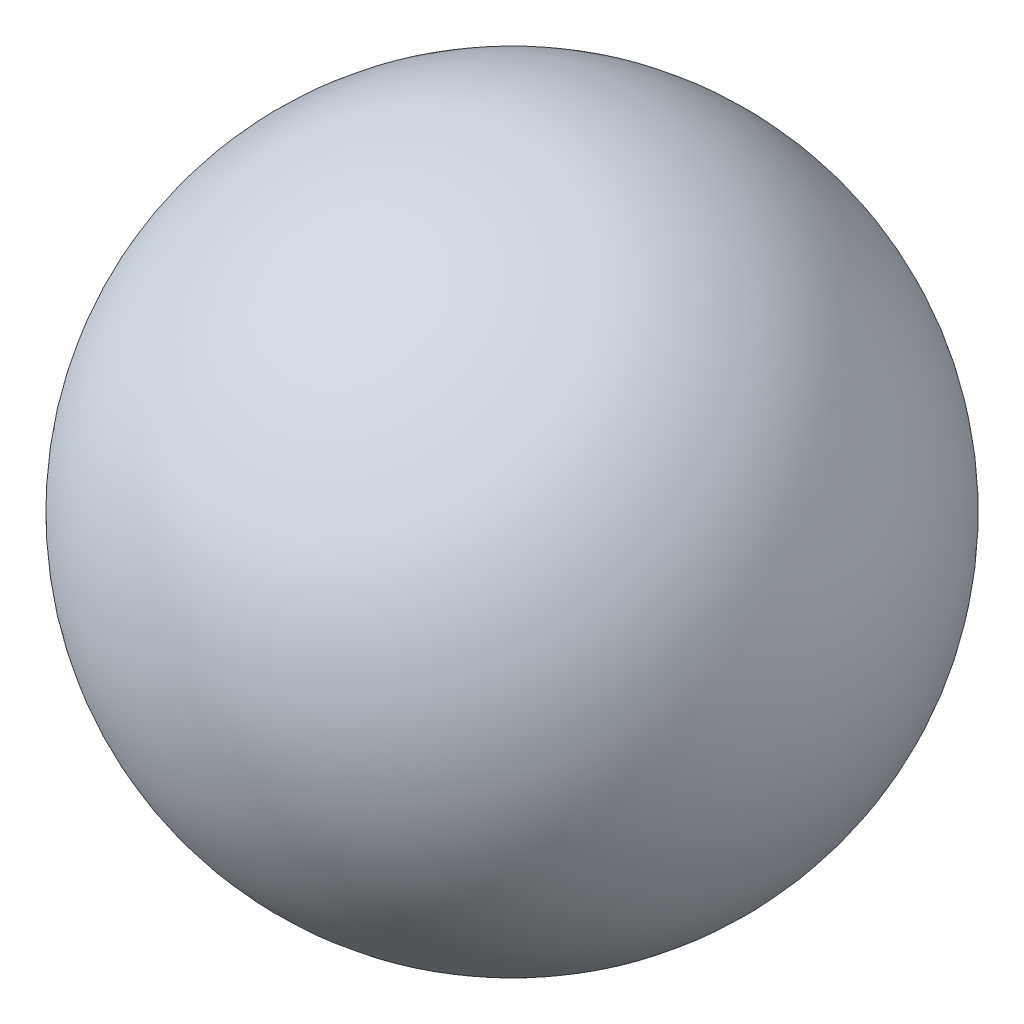
ISO-10303-21;
HEADER;
FILE_DESCRIPTION(('STEP AP214'),'2;1');
FILE_NAME('part.step','',(''),(''),'','','');
FILE_SCHEMA(('AUTOMOTIVE_DESIGN { 1 0 10303 214 1 1 1 1 }'));
ENDSEC;
DATA;
#1=APPLICATION_CONTEXT('core data for automotive mechanical design processes');
#2=APPLICATION_PROTOCOL_DEFINITION('international standard','automotive_design',2000,#1);
#3=PRODUCT_CONTEXT('',#1,'mechanical');
#4=PRODUCT('Part','Part','',(#3));
#5=PRODUCT_RELATED_PRODUCT_CATEGORY('part','',(#4));
#6=PRODUCT_DEFINITION_FORMATION('','',#4);
#7=PRODUCT_DEFINITION_CONTEXT('part definition',#1,'design');
#8=PRODUCT_DEFINITION('design','',#6,#7);
#9=PRODUCT_DEFINITION_SHAPE('','',#8);
#10=(LENGTH_UNIT() NAMED_UNIT(*) SI_UNIT(.MILLI.,.METRE.));
#11=(NAMED_UNIT(*) PLANE_ANGLE_UNIT() SI_UNIT($,.RADIAN.));
#12=(NAMED_UNIT(*) SI_UNIT($,.STERADIAN.) SOLID_ANGLE_UNIT());
#13=UNCERTAINTY_MEASURE_WITH_UNIT(LENGTH_MEASURE(1.E-05),#10,'distance_accuracy_value','');
#14=(GEOMETRIC_REPRESENTATION_CONTEXT(3) GLOBAL_UNCERTAINTY_ASSIGNED_CONTEXT((#13)) GLOBAL_UNIT_ASSIGNED_CONTEXT((#10,
#11,#12)) REPRESENTATION_CONTEXT('',''));
#15=CARTESIAN_POINT('',(0.,0.,0.));
#16=DIRECTION('',(0.,0.,1.));
#17=DIRECTION('',(1.,0.,0.));
#18=AXIS2_PLACEMENT_3D('',#15,#16,#17);
#19=CARTESIAN_POINT('',(0.,0.,0.));
#20=DIRECTION('',(0.,1.,0.));
#21=DIRECTION('',(1.,0.,0.));
#22=AXIS2_PLACEMENT_3D('',#19,#20,#21);
#23=SPHERICAL_SURFACE('',#22,110.);
#24=CARTESIAN_POINT('',(0.,110.,0.));
#25=VERTEX_POINT('',#24);
#26=VERTEX_LOOP('',#25);
#27=FACE_BOUND('',#26,.T.);
#28=ADVANCED_FACE('F29',(#27),#23,.T.);
#29=CLOSED_SHELL('',(#28));
#30=MANIFOLD_SOLID_BREP('B2',#29);
#31=ADVANCED_BREP_SHAPE_REPRESENTATION('',(#18,#30),#14);
#32=SHAPE_DEFINITION_REPRESENTATION(#9,#31);
ENDSEC;
END-ISO-10303-21;
